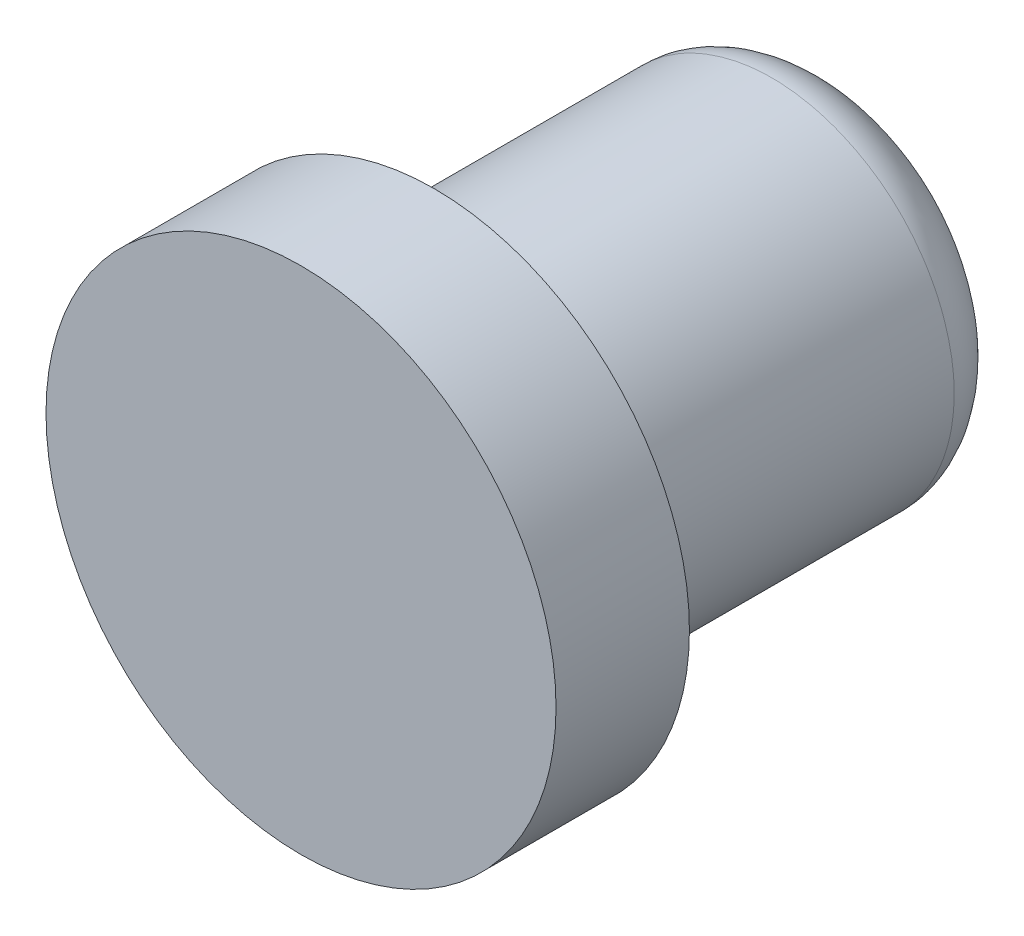
ISO-10303-21;
HEADER;
FILE_DESCRIPTION(('STEP AP214'),'2;1');
FILE_NAME('part.step','',(''),(''),'','','');
FILE_SCHEMA(('AUTOMOTIVE_DESIGN { 1 0 10303 214 1 1 1 1 }'));
ENDSEC;
DATA;
#1=APPLICATION_CONTEXT('core data for automotive mechanical design processes');
#2=APPLICATION_PROTOCOL_DEFINITION('international standard','automotive_design',2000,#1);
#3=PRODUCT_CONTEXT('',#1,'mechanical');
#4=PRODUCT('Part','Part','',(#3));
#5=PRODUCT_RELATED_PRODUCT_CATEGORY('part','',(#4));
#6=PRODUCT_DEFINITION_FORMATION('','',#4);
#7=PRODUCT_DEFINITION_CONTEXT('part definition',#1,'design');
#8=PRODUCT_DEFINITION('design','',#6,#7);
#9=PRODUCT_DEFINITION_SHAPE('','',#8);
#10=(LENGTH_UNIT() NAMED_UNIT(*) SI_UNIT(.MILLI.,.METRE.));
#11=(NAMED_UNIT(*) PLANE_ANGLE_UNIT() SI_UNIT($,.RADIAN.));
#12=(NAMED_UNIT(*) SI_UNIT($,.STERADIAN.) SOLID_ANGLE_UNIT());
#13=UNCERTAINTY_MEASURE_WITH_UNIT(LENGTH_MEASURE(1.E-05),#10,'distance_accuracy_value','');
#14=(GEOMETRIC_REPRESENTATION_CONTEXT(3) GLOBAL_UNCERTAINTY_ASSIGNED_CONTEXT((#13)) GLOBAL_UNIT_ASSIGNED_CONTEXT((#10,
#11,#12)) REPRESENTATION_CONTEXT('',''));
#15=CARTESIAN_POINT('',(0.,0.,0.));
#16=DIRECTION('',(0.,0.,1.));
#17=DIRECTION('',(1.,0.,0.));
#18=AXIS2_PLACEMENT_3D('',#15,#16,#17);
#19=CARTESIAN_POINT('',(-4.65,0.,2.));
#20=CARTESIAN_POINT('',(-4.65,-1.21736707874097,2.));
#21=CARTESIAN_POINT('',(-4.14885504908851,-2.42723801594638,2.));
#22=CARTESIAN_POINT('',(-2.42723801594637,-4.14885504908852,2.));
#23=CARTESIAN_POINT('',(-1.21736707874097,-4.65,2.));
#24=CARTESIAN_POINT('',(1.21736707874097,-4.65,2.));
#25=CARTESIAN_POINT('',(2.42723801594658,-4.14885504908831,2.));
#26=CARTESIAN_POINT('',(4.14885504908831,-2.42723801594658,2.));
#27=CARTESIAN_POINT('',(4.65,-1.21736707874155,2.));
#28=CARTESIAN_POINT('',(4.65,1.21736707874155,2.));
#29=CARTESIAN_POINT('',(4.1488550490885,2.42723801594639,2.));
#30=CARTESIAN_POINT('',(2.42723801594639,4.1488550490885,2.));
#31=CARTESIAN_POINT('',(1.21736707874097,4.65,2.));
#32=CARTESIAN_POINT('',(-1.21736707874097,4.65,2.));
#33=CARTESIAN_POINT('',(-2.42723801594647,4.14885504908842,2.));
#34=CARTESIAN_POINT('',(-4.14885504908842,2.42723801594647,2.));
#35=CARTESIAN_POINT('',(-4.65,1.21736707874097,2.));
#36=CARTESIAN_POINT('',(-4.65,0.,2.));
#37=CARTESIAN_POINT('',(-4.65,0.,0.));
#38=CARTESIAN_POINT('',(-4.65,-1.21736707874097,0.));
#39=CARTESIAN_POINT('',(-4.14885504908823,-2.42723801594629,0.));
#40=CARTESIAN_POINT('',(-2.42723801594666,-4.14885504908861,0.));
#41=CARTESIAN_POINT('',(-1.21736707874097,-4.65,0.));
#42=CARTESIAN_POINT('',(1.21736707874097,-4.65,0.));
#43=CARTESIAN_POINT('',(2.42723801594663,-4.14885504908817,0.));
#44=CARTESIAN_POINT('',(4.14885504908827,-2.42723801594672,0.));
#45=CARTESIAN_POINT('',(4.65,-1.21736707874155,0.));
#46=CARTESIAN_POINT('',(4.65,1.21736707874155,0.));
#47=CARTESIAN_POINT('',(4.14885504908864,2.42723801594663,0.));
#48=CARTESIAN_POINT('',(2.42723801594625,4.14885504908826,0.));
#49=CARTESIAN_POINT('',(1.21736707874097,4.65,0.));
#50=CARTESIAN_POINT('',(-1.21736707874097,4.65,0.));
#51=CARTESIAN_POINT('',(-2.42723801594647,4.14885504908833,0.));
#52=CARTESIAN_POINT('',(-4.14885504908843,2.42723801594656,0.));
#53=CARTESIAN_POINT('',(-4.65,1.21736707874097,0.));
#54=CARTESIAN_POINT('',(-4.65,0.,0.));
#55=CARTESIAN_POINT('',(-1.65,0.,0.));
#56=CARTESIAN_POINT('',(-1.65,-0.431968963424214,0.));
#57=CARTESIAN_POINT('',(-1.47217437225721,-0.861278005658393,0.));
#58=CARTESIAN_POINT('',(-0.861278005658391,-1.47217437225722,0.));
#59=CARTESIAN_POINT('',(-0.431968963424213,-1.65,0.));
#60=CARTESIAN_POINT('',(0.431968963424216,-1.65,0.));
#61=CARTESIAN_POINT('',(0.861278005658449,-1.47217437225711,0.));
#62=CARTESIAN_POINT('',(1.47217437225716,-0.861278005658494,0.));
#63=CARTESIAN_POINT('',(1.65,-0.431968963424422,0.));
#64=CARTESIAN_POINT('',(1.65,0.431968963424422,0.));
#65=CARTESIAN_POINT('',(1.47217437225721,0.861278005658354,0.));
#66=CARTESIAN_POINT('',(0.861278005658401,1.47217437225725,0.));
#67=CARTESIAN_POINT('',(0.431968963424215,1.65,0.));
#68=CARTESIAN_POINT('',(-0.431968963424214,1.65,0.));
#69=CARTESIAN_POINT('',(-0.86127800565844,1.47217437225717,0.));
#70=CARTESIAN_POINT('',(-1.47217437225717,0.861278005658438,0.));
#71=CARTESIAN_POINT('',(-1.65,0.431968963424215,0.));
#72=CARTESIAN_POINT('',(-1.65,0.,0.));
#73=(BOUNDED_SURFACE() B_SPLINE_SURFACE(2,3,((#19,#20,#21,#22,#23,#24,#25,#26,#27,#28,#29,#30,
#31,#32,#33,#34,#35,#36),(#37,#38,#39,#40,#41,#42,#43,#44,#45,#46,#47,#48,#49,#50,#51,#52,#53,
#54),(#55,#56,#57,#58,#59,#60,#61,#62,#63,#64,#65,#66,#67,#68,#69,#70,#71,#72)),.UNSPECIFIED.,
.F.,.T.,.F.) B_SPLINE_SURFACE_WITH_KNOTS((3,3),(4,2,2,2,2,2,2,2,4),(0.,1.),(-3.14159265358979,
-2.35619449019234,-1.5707963267949,-0.785398163397448,0.,0.785398163397448,1.5707963267949,
2.35619449019234,3.14159265358979),
.UNSPECIFIED.) GEOMETRIC_REPRESENTATION_ITEM() RATIONAL_B_SPLINE_SURFACE(((1.,1.,1.,1.,1.,1.,1.,
1.,1.,1.,1.,1.,1.,1.,1.,1.,1.,1.),(0.707106781186548,0.707106781186548,0.707106781186548,
0.707106781186548,0.707106781186548,0.707106781186548,0.707106781186548,0.707106781186548,
0.707106781186548,0.707106781186548,0.707106781186548,0.707106781186548,0.707106781186548,
0.707106781186548,0.707106781186548,0.707106781186548,0.707106781186548,0.707106781186548),(1.,
1.,1.,1.,1.,1.,1.,1.,1.,1.,1.,1.,1.,1.,1.,1.,1.,1.))) REPRESENTATION_ITEM('') SURFACE());
#74=CARTESIAN_POINT('',(-1.65,0.,0.));
#75=CARTESIAN_POINT('',(-1.65,-0.431968963424214,0.));
#76=CARTESIAN_POINT('',(-1.47217437225721,-0.861278005658393,0.));
#77=CARTESIAN_POINT('',(-0.861278005658391,-1.47217437225722,0.));
#78=CARTESIAN_POINT('',(-0.431968963424213,-1.65,0.));
#79=CARTESIAN_POINT('',(0.431968963424216,-1.65,0.));
#80=CARTESIAN_POINT('',(0.861278005658449,-1.47217437225711,0.));
#81=CARTESIAN_POINT('',(1.47217437225716,-0.861278005658494,0.));
#82=CARTESIAN_POINT('',(1.65,-0.431968963424422,0.));
#83=CARTESIAN_POINT('',(1.65,0.431968963424422,0.));
#84=CARTESIAN_POINT('',(1.47217437225721,0.861278005658354,0.));
#85=CARTESIAN_POINT('',(0.861278005658401,1.47217437225725,0.));
#86=CARTESIAN_POINT('',(0.431968963424215,1.65,0.));
#87=CARTESIAN_POINT('',(-0.431968963424214,1.65,0.));
#88=CARTESIAN_POINT('',(-0.86127800565844,1.47217437225717,0.));
#89=CARTESIAN_POINT('',(-1.47217437225717,0.861278005658438,0.));
#90=CARTESIAN_POINT('',(-1.65,0.431968963424215,0.));
#91=CARTESIAN_POINT('',(-1.65,0.,0.));
#92=(BOUNDED_CURVE() B_SPLINE_CURVE(3,(#74,#75,#76,#77,#78,#79,#80,#81,#82,#83,#84,#85,#86,#87,
#88,#89,#90,#91),.UNSPECIFIED.,.T.,.F.) B_SPLINE_CURVE_WITH_KNOTS((4,2,2,2,2,2,2,2,4),
(-3.14159265358979,-2.35619449019234,-1.5707963267949,-0.785398163397448,0.,0.785398163397448,
1.5707963267949,2.35619449019234,3.14159265358979),
.UNSPECIFIED.) CURVE() GEOMETRIC_REPRESENTATION_ITEM() RATIONAL_B_SPLINE_CURVE((1.,1.,1.,1.,1.,
1.,1.,1.,1.,1.,1.,1.,1.,1.,1.,1.,1.,1.)) REPRESENTATION_ITEM(''));
#93=CARTESIAN_POINT('',(-1.65,0.,0.));
#94=VERTEX_POINT('',#93);
#95=EDGE_CURVE('E50',#94,#94,#92,.F.);
#96=CARTESIAN_POINT('',(-4.65,0.,2.));
#97=CARTESIAN_POINT('',(-4.65,1.21736707874097,2.));
#98=CARTESIAN_POINT('',(-4.14885504908842,2.42723801594647,2.));
#99=CARTESIAN_POINT('',(-2.42723801594647,4.14885504908842,2.));
#100=CARTESIAN_POINT('',(-1.21736707874097,4.65,2.));
#101=CARTESIAN_POINT('',(1.21736707874097,4.65,2.));
#102=CARTESIAN_POINT('',(2.42723801594639,4.1488550490885,2.));
#103=CARTESIAN_POINT('',(4.1488550490885,2.42723801594639,2.));
#104=CARTESIAN_POINT('',(4.65,1.21736707874155,2.));
#105=CARTESIAN_POINT('',(4.65,-1.21736707874155,2.));
#106=CARTESIAN_POINT('',(4.14885504908831,-2.42723801594658,2.));
#107=CARTESIAN_POINT('',(2.42723801594658,-4.14885504908831,2.));
#108=CARTESIAN_POINT('',(1.21736707874097,-4.65,2.));
#109=CARTESIAN_POINT('',(-1.21736707874097,-4.65,2.));
#110=CARTESIAN_POINT('',(-2.42723801594637,-4.14885504908852,2.));
#111=CARTESIAN_POINT('',(-4.14885504908851,-2.42723801594638,2.));
#112=CARTESIAN_POINT('',(-4.65,-1.21736707874097,2.));
#113=CARTESIAN_POINT('',(-4.65,0.,2.));
#114=(BOUNDED_CURVE() B_SPLINE_CURVE(3,(#96,#97,#98,#99,#100,#101,#102,#103,#104,#105,#106,#107,
#108,#109,#110,#111,#112,#113),.UNSPECIFIED.,.T.,.F.) B_SPLINE_CURVE_WITH_KNOTS((4,2,2,2,2,2,2,
2,4),(-3.14159265358979,-2.35619449019234,-1.5707963267949,-0.785398163397448,0.,
0.785398163397448,1.5707963267949,2.35619449019234,3.14159265358979),
.UNSPECIFIED.) CURVE() GEOMETRIC_REPRESENTATION_ITEM() RATIONAL_B_SPLINE_CURVE((1.,1.,1.,1.,1.,
1.,1.,1.,1.,1.,1.,1.,1.,1.,1.,1.,1.,1.)) REPRESENTATION_ITEM(''));
#115=CARTESIAN_POINT('',(-4.65,0.,2.));
#116=VERTEX_POINT('',#115);
#117=EDGE_CURVE('E46',#116,#116,#114,.F.);
#118=ORIENTED_EDGE('',*,*,#95,.F.);
#119=EDGE_LOOP('',(#118));
#120=FACE_BOUND('',#119,.T.);
#121=ORIENTED_EDGE('',*,*,#117,.F.);
#122=EDGE_LOOP('',(#121));
#123=FACE_BOUND('',#122,.T.);
#124=ADVANCED_FACE('F36',(#120,#123),#73,.T.);
#125=CARTESIAN_POINT('',(0.,0.,10.));
#126=DIRECTION('',(0.,0.,-1.));
#127=DIRECTION('',(-1.,0.,0.));
#128=AXIS2_PLACEMENT_3D('',#125,#126,#127);
#129=CYLINDRICAL_SURFACE('',#128,4.65);
#130=CARTESIAN_POINT('',(0.,0.,10.4));
#131=DIRECTION('',(0.,0.,-1.));
#132=DIRECTION('',(-1.,0.,0.));
#133=AXIS2_PLACEMENT_3D('',#130,#131,#132);
#134=CIRCLE('',#133,4.65);
#135=CARTESIAN_POINT('',(-4.65,0.,10.4));
#136=VERTEX_POINT('',#135);
#137=EDGE_CURVE('E11',#136,#136,#134,.T.);
#138=ORIENTED_EDGE('',*,*,#137,.T.);
#139=EDGE_LOOP('',(#138));
#140=FACE_BOUND('',#139,.T.);
#141=ORIENTED_EDGE('',*,*,#117,.T.);
#142=EDGE_LOOP('',(#141));
#143=FACE_BOUND('',#142,.T.);
#144=ADVANCED_FACE('F70',(#140,#143),#129,.T.);
#145=CARTESIAN_POINT('',(0.,0.,0.));
#146=DIRECTION('',(0.,0.,1.));
#147=DIRECTION('',(1.,0.,0.));
#148=AXIS2_PLACEMENT_3D('',#145,#146,#147);
#149=PLANE('',#148);
#150=ORIENTED_EDGE('',*,*,#95,.T.);
#151=EDGE_LOOP('',(#150));
#152=FACE_BOUND('',#151,.T.);
#153=ADVANCED_FACE('F121',(#152),#149,.F.);
#154=CARTESIAN_POINT('',(0.,0.,14.));
#155=DIRECTION('',(0.,0.,1.));
#156=DIRECTION('',(1.,0.,0.));
#157=AXIS2_PLACEMENT_3D('',#154,#155,#156);
#158=PLANE('',#157);
#159=CARTESIAN_POINT('',(0.,0.,14.));
#160=DIRECTION('',(0.,0.,1.));
#161=DIRECTION('',(1.,0.,0.));
#162=AXIS2_PLACEMENT_3D('',#159,#160,#161);
#163=CIRCLE('',#162,6.5);
#164=CARTESIAN_POINT('',(6.5,0.,14.));
#165=VERTEX_POINT('',#164);
#166=EDGE_CURVE('E150',#165,#165,#163,.T.);
#167=ORIENTED_EDGE('',*,*,#166,.T.);
#168=EDGE_LOOP('',(#167));
#169=FACE_BOUND('',#168,.T.);
#170=ADVANCED_FACE('F130',(#169),#158,.T.);
#171=CARTESIAN_POINT('',(0.,0.,14.));
#172=DIRECTION('',(0.,0.,-1.));
#173=DIRECTION('',(-1.,0.,0.));
#174=AXIS2_PLACEMENT_3D('',#171,#172,#173);
#175=CYLINDRICAL_SURFACE('',#174,6.5);
#176=ORIENTED_EDGE('',*,*,#166,.F.);
#177=EDGE_LOOP('',(#176));
#178=FACE_BOUND('',#177,.T.);
#179=CARTESIAN_POINT('',(0.,0.,10.6));
#180=DIRECTION('',(0.,0.,-1.));
#181=DIRECTION('',(-1.,0.,0.));
#182=AXIS2_PLACEMENT_3D('',#179,#180,#181);
#183=CIRCLE('',#182,6.5);
#184=CARTESIAN_POINT('',(-6.5,0.,10.6));
#185=VERTEX_POINT('',#184);
#186=EDGE_CURVE('E148',#185,#185,#183,.T.);
#187=ORIENTED_EDGE('',*,*,#186,.F.);
#188=EDGE_LOOP('',(#187));
#189=FACE_BOUND('',#188,.T.);
#190=ADVANCED_FACE('F132',(#178,#189),#175,.T.);
#191=CARTESIAN_POINT('',(0.,0.,10.6));
#192=DIRECTION('',(0.,0.,-1.));
#193=DIRECTION('',(-1.,0.,0.));
#194=AXIS2_PLACEMENT_3D('',#191,#192,#193);
#195=PLANE('',#194);
#196=CARTESIAN_POINT('',(0.,0.,10.6));
#197=DIRECTION('',(0.,0.,-1.));
#198=DIRECTION('',(-1.,0.,0.));
#199=AXIS2_PLACEMENT_3D('',#196,#197,#198);
#200=CIRCLE('',#199,4.85);
#201=CARTESIAN_POINT('',(-4.85,0.,10.6));
#202=VERTEX_POINT('',#201);
#203=EDGE_CURVE('E42',#202,#202,#200,.F.);
#204=ORIENTED_EDGE('',*,*,#203,.T.);
#205=EDGE_LOOP('',(#204));
#206=FACE_BOUND('',#205,.T.);
#207=ORIENTED_EDGE('',*,*,#186,.T.);
#208=EDGE_LOOP('',(#207));
#209=FACE_BOUND('',#208,.T.);
#210=ADVANCED_FACE('F135',(#206,#209),#195,.T.);
#211=CARTESIAN_POINT('',(0.,0.,10.4));
#212=DIRECTION('',(0.,0.,-1.));
#213=DIRECTION('',(-1.,0.,0.));
#214=AXIS2_PLACEMENT_3D('',#211,#212,#213);
#215=TOROIDAL_SURFACE('',#214,4.85,0.2);
#216=ORIENTED_EDGE('',*,*,#137,.F.);
#217=EDGE_LOOP('',(#216));
#218=FACE_BOUND('',#217,.T.);
#219=ORIENTED_EDGE('',*,*,#203,.F.);
#220=EDGE_LOOP('',(#219));
#221=FACE_BOUND('',#220,.T.);
#222=ADVANCED_FACE('F38',(#218,#221),#215,.F.);
#223=CLOSED_SHELL('',(#124,#144,#153,#170,#190,#210,#222));
#224=MANIFOLD_SOLID_BREP('B2',#223);
#225=ADVANCED_BREP_SHAPE_REPRESENTATION('',(#18,#224),#14);
#226=SHAPE_DEFINITION_REPRESENTATION(#9,#225);
ENDSEC;
END-ISO-10303-21;
